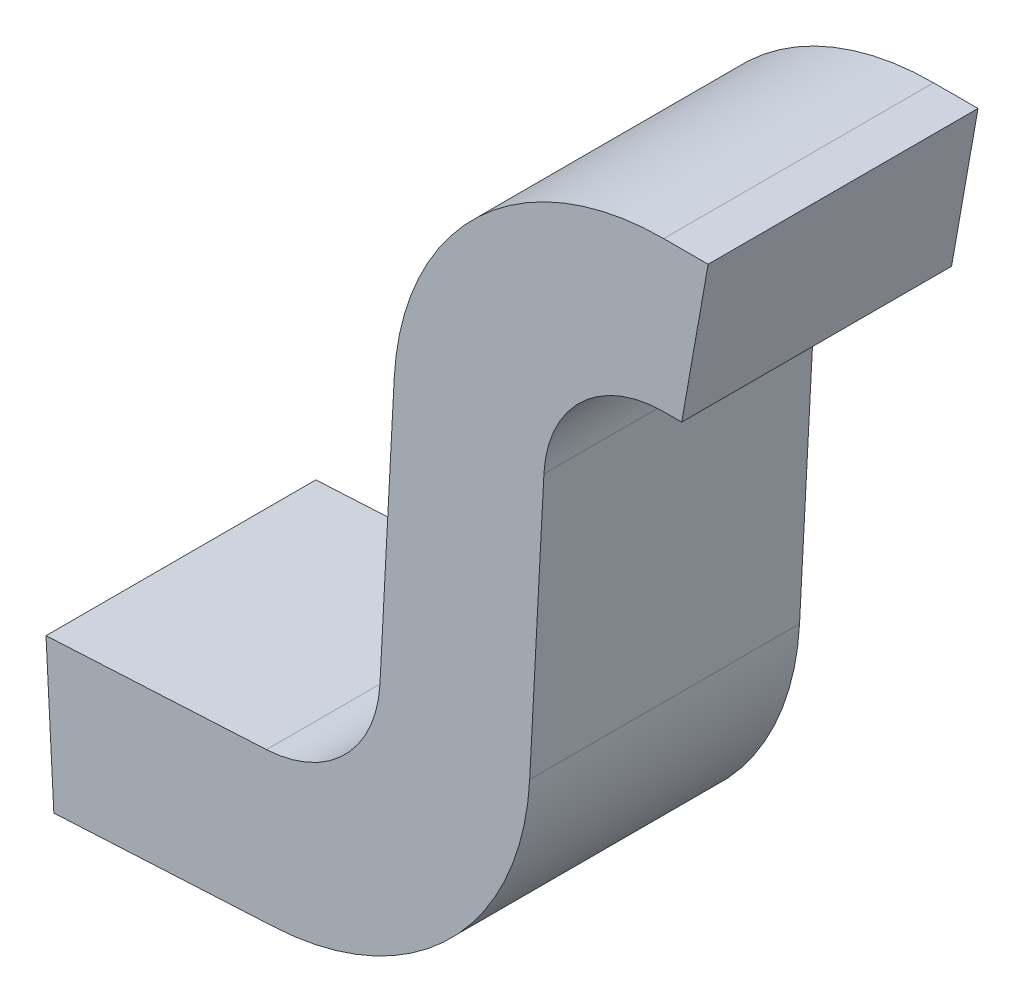
ISO-10303-21;
HEADER;
FILE_DESCRIPTION(('STEP AP214'),'2;1');
FILE_NAME('part.step','',(''),(''),'','','');
FILE_SCHEMA(('AUTOMOTIVE_DESIGN { 1 0 10303 214 1 1 1 1 }'));
ENDSEC;
DATA;
#1=APPLICATION_CONTEXT('core data for automotive mechanical design processes');
#2=APPLICATION_PROTOCOL_DEFINITION('international standard','automotive_design',2000,#1);
#3=PRODUCT_CONTEXT('',#1,'mechanical');
#4=PRODUCT('Part','Part','',(#3));
#5=PRODUCT_RELATED_PRODUCT_CATEGORY('part','',(#4));
#6=PRODUCT_DEFINITION_FORMATION('','',#4);
#7=PRODUCT_DEFINITION_CONTEXT('part definition',#1,'design');
#8=PRODUCT_DEFINITION('design','',#6,#7);
#9=PRODUCT_DEFINITION_SHAPE('','',#8);
#10=(LENGTH_UNIT() NAMED_UNIT(*) SI_UNIT(.MILLI.,.METRE.));
#11=(NAMED_UNIT(*) PLANE_ANGLE_UNIT() SI_UNIT($,.RADIAN.));
#12=(NAMED_UNIT(*) SI_UNIT($,.STERADIAN.) SOLID_ANGLE_UNIT());
#13=UNCERTAINTY_MEASURE_WITH_UNIT(LENGTH_MEASURE(1.E-05),#10,'distance_accuracy_value','');
#14=(GEOMETRIC_REPRESENTATION_CONTEXT(3) GLOBAL_UNCERTAINTY_ASSIGNED_CONTEXT((#13)) GLOBAL_UNIT_ASSIGNED_CONTEXT((#10,
#11,#12)) REPRESENTATION_CONTEXT('',''));
#15=CARTESIAN_POINT('',(0.,0.,0.));
#16=DIRECTION('',(0.,0.,1.));
#17=DIRECTION('',(1.,0.,0.));
#18=AXIS2_PLACEMENT_3D('',#15,#16,#17);
#19=CARTESIAN_POINT('',(0.,0.,0.1125));
#20=DIRECTION('',(0.,0.,-1.));
#21=DIRECTION('',(-1.,0.,0.));
#22=AXIS2_PLACEMENT_3D('',#19,#20,#21);
#23=PLANE('',#22);
#24=DIRECTION('',(0.0523359562429177,0.998629534754575,0.));
#25=VECTOR('',#24,1.);
#26=CARTESIAN_POINT('',(-0.861573213012,-0.31493822705,0.1125));
#27=LINE('',#26,#25);
#28=CARTESIAN_POINT('',(-0.849691645319655,-0.0882244098453541,0.1125));
#29=VERTEX_POINT('',#28);
#30=CARTESIAN_POINT('',(-0.861573213012008,-0.31493822705016,0.1125));
#31=VERTEX_POINT('',#30);
#32=EDGE_CURVE('E145',#29,#31,#27,.F.);
#33=ORIENTED_EDGE('',*,*,#32,.T.);
#34=CARTESIAN_POINT('',(-0.961436166488,-0.309704631426,0.1125));
#35=DIRECTION('',(0.,0.,-1.));
#36=DIRECTION('',(-1.,0.,0.));
#37=AXIS2_PLACEMENT_3D('',#34,#35,#36);
#38=CIRCLE('',#37,0.1);
#39=CARTESIAN_POINT('',(-0.956202570863354,-0.40956758490123,0.1125));
#40=VERTEX_POINT('',#39);
#41=EDGE_CURVE('E181',#31,#40,#38,.T.);
#42=ORIENTED_EDGE('',*,*,#41,.T.);
#43=DIRECTION('',(0.998629534754575,0.0523359562429177,0.));
#44=VECTOR('',#43,1.);
#45=CARTESIAN_POINT('',(-1.14,-0.4192,0.1125));
#46=LINE('',#45,#44);
#47=CARTESIAN_POINT('',(-1.14000000000012,-0.419200000000006,0.1125));
#48=VERTEX_POINT('',#47);
#49=EDGE_CURVE('E149',#40,#48,#46,.F.);
#50=ORIENTED_EDGE('',*,*,#49,.T.);
#51=DIRECTION('',(-0.0523359562429177,0.998629534754575,0.));
#52=VECTOR('',#51,1.);
#53=CARTESIAN_POINT('',(-1.13345800547,-0.544028691844,0.1125));
#54=LINE('',#53,#52);
#55=CARTESIAN_POINT('',(-1.13345800547,-0.544028691843999,0.1125));
#56=VERTEX_POINT('',#55);
#57=EDGE_CURVE('E155',#48,#56,#54,.F.);
#58=ORIENTED_EDGE('',*,*,#57,.T.);
#59=DIRECTION('',(-0.998629534754575,-0.0523359562429177,0.));
#60=VECTOR('',#59,1.);
#61=CARTESIAN_POINT('',(-0.949660576333,-0.534396276745,0.1125));
#62=LINE('',#61,#60);
#63=CARTESIAN_POINT('',(-0.949660576333192,-0.53439627674501,0.1125));
#64=VERTEX_POINT('',#63);
#65=EDGE_CURVE('E160',#56,#64,#62,.F.);
#66=ORIENTED_EDGE('',*,*,#65,.T.);
#67=CARTESIAN_POINT('',(-0.961436166488,-0.309704631426,0.1125));
#68=DIRECTION('',(0.,0.,-1.));
#69=DIRECTION('',(-1.,0.,0.));
#70=AXIS2_PLACEMENT_3D('',#67,#68,#69);
#71=CIRCLE('',#70,0.225);
#72=CARTESIAN_POINT('',(-0.736744521168336,-0.321480221580316,0.1125));
#73=VERTEX_POINT('',#72);
#74=EDGE_CURVE('E108',#73,#64,#71,.T.);
#75=ORIENTED_EDGE('',*,*,#74,.F.);
#76=DIRECTION('',(-0.0523359562429177,-0.998629534754575,0.));
#77=VECTOR('',#76,1.);
#78=CARTESIAN_POINT('',(-0.724862953476,-0.09476640437571,0.1125));
#79=LINE('',#78,#77);
#80=CARTESIAN_POINT('',(-0.724862953475999,-0.0947664043756949,0.1125));
#81=VERTEX_POINT('',#80);
#82=EDGE_CURVE('E103',#73,#81,#79,.F.);
#83=ORIENTED_EDGE('',*,*,#82,.T.);
#84=CARTESIAN_POINT('',(-0.625,-0.1,0.1125));
#85=DIRECTION('',(0.,0.,-1.));
#86=DIRECTION('',(-1.,0.,0.));
#87=AXIS2_PLACEMENT_3D('',#84,#85,#86);
#88=CIRCLE('',#87,0.1);
#89=CARTESIAN_POINT('',(-0.625,0.,0.1125));
#90=VERTEX_POINT('',#89);
#91=EDGE_CURVE('E20',#81,#90,#88,.T.);
#92=ORIENTED_EDGE('',*,*,#91,.T.);
#93=DIRECTION('',(1.,0.,0.));
#94=VECTOR('',#93,1.);
#95=CARTESIAN_POINT('',(-0.61,0.,0.1125));
#96=LINE('',#95,#94);
#97=CARTESIAN_POINT('',(-0.609999999999862,0.,0.1125));
#98=VERTEX_POINT('',#97);
#99=EDGE_CURVE('E129',#90,#98,#96,.T.);
#100=ORIENTED_EDGE('',*,*,#99,.T.);
#101=DIRECTION('',(-0.173648177667033,-0.98480775301219,0.));
#102=VECTOR('',#101,1.);
#103=CARTESIAN_POINT('',(-0.587959127411,0.125,0.1125));
#104=LINE('',#103,#102);
#105=CARTESIAN_POINT('',(-0.587959127411,0.125,0.1125));
#106=VERTEX_POINT('',#105);
#107=EDGE_CURVE('E134',#98,#106,#104,.F.);
#108=ORIENTED_EDGE('',*,*,#107,.T.);
#109=DIRECTION('',(1.,0.,0.));
#110=VECTOR('',#109,1.);
#111=CARTESIAN_POINT('',(-0.625,0.125,0.1125));
#112=LINE('',#111,#110);
#113=CARTESIAN_POINT('',(-0.625,0.125,0.1125));
#114=VERTEX_POINT('',#113);
#115=EDGE_CURVE('E140',#106,#114,#112,.F.);
#116=ORIENTED_EDGE('',*,*,#115,.T.);
#117=CARTESIAN_POINT('',(-0.625,-0.1,0.1125));
#118=DIRECTION('',(0.,0.,-1.));
#119=DIRECTION('',(-1.,0.,0.));
#120=AXIS2_PLACEMENT_3D('',#117,#118,#119);
#121=CIRCLE('',#120,0.225);
#122=EDGE_CURVE('E142',#29,#114,#121,.T.);
#123=ORIENTED_EDGE('',*,*,#122,.F.);
#124=EDGE_LOOP('',(#33,#42,#50,#58,#66,#75,#83,#92,#100,#108,#116,#123));
#125=FACE_BOUND('',#124,.T.);
#126=ADVANCED_FACE('F17',(#125),#23,.F.);
#127=CARTESIAN_POINT('',(-0.625,-0.1,-0.1125));
#128=DIRECTION('',(0.,0.,-1.));
#129=DIRECTION('',(-1.,0.,0.));
#130=AXIS2_PLACEMENT_3D('',#127,#128,#129);
#131=CYLINDRICAL_SURFACE('',#130,0.1);
#132=ORIENTED_EDGE('',*,*,#91,.F.);
#133=DIRECTION('',(0.,0.,1.));
#134=VECTOR('',#133,1.);
#135=CARTESIAN_POINT('',(-0.724862953476,-0.09476640437571,-0.1125));
#136=LINE('',#135,#134);
#137=CARTESIAN_POINT('',(-0.724862953476004,-0.0947664043757943,-0.1125));
#138=VERTEX_POINT('',#137);
#139=EDGE_CURVE('E112',#81,#138,#136,.F.);
#140=ORIENTED_EDGE('',*,*,#139,.T.);
#141=CARTESIAN_POINT('',(-0.625,-0.1,-0.1125));
#142=DIRECTION('',(0.,0.,-1.));
#143=DIRECTION('',(-1.,0.,0.));
#144=AXIS2_PLACEMENT_3D('',#141,#142,#143);
#145=CIRCLE('',#144,0.1);
#146=CARTESIAN_POINT('',(-0.625,0.,-0.1125));
#147=VERTEX_POINT('',#146);
#148=EDGE_CURVE('E131',#147,#138,#145,.F.);
#149=ORIENTED_EDGE('',*,*,#148,.F.);
#150=DIRECTION('',(0.,0.,1.));
#151=VECTOR('',#150,1.);
#152=CARTESIAN_POINT('',(-0.625,0.,-0.1125));
#153=LINE('',#152,#151);
#154=EDGE_CURVE('E118',#147,#90,#153,.T.);
#155=ORIENTED_EDGE('',*,*,#154,.T.);
#156=EDGE_LOOP('',(#132,#140,#149,#155));
#157=FACE_BOUND('',#156,.T.);
#158=ADVANCED_FACE('F115',(#157),#131,.F.);
#159=CARTESIAN_POINT('',(-0.724862953476,-0.09476640437571,-0.1125));
#160=DIRECTION('',(-0.998629534754575,0.0523359562429177,0.));
#161=DIRECTION('',(-0.0523359562429177,-0.998629534754575,0.));
#162=AXIS2_PLACEMENT_3D('',#159,#160,#161);
#163=PLANE('',#162);
#164=ORIENTED_EDGE('',*,*,#82,.F.);
#165=DIRECTION('',(0.,0.,-1.));
#166=VECTOR('',#165,1.);
#167=CARTESIAN_POINT('',(-0.736744521168186,-0.32148022157999,-0.1125));
#168=LINE('',#167,#166);
#169=CARTESIAN_POINT('',(-0.736744521168099,-0.321480221580105,-0.1125));
#170=VERTEX_POINT('',#169);
#171=EDGE_CURVE('E124',#170,#73,#168,.F.);
#172=ORIENTED_EDGE('',*,*,#171,.F.);
#173=DIRECTION('',(-0.0523359562409312,-0.998629534754679,0.));
#174=VECTOR('',#173,1.);
#175=CARTESIAN_POINT('',(-0.724862953476,-0.09476640437571,-0.1125));
#176=LINE('',#175,#174);
#177=EDGE_CURVE('E122',#138,#170,#176,.T.);
#178=ORIENTED_EDGE('',*,*,#177,.F.);
#179=ORIENTED_EDGE('',*,*,#139,.F.);
#180=EDGE_LOOP('',(#164,#172,#178,#179));
#181=FACE_BOUND('',#180,.T.);
#182=ADVANCED_FACE('F120',(#181),#163,.F.);
#183=CARTESIAN_POINT('',(-0.961436166488,-0.309704631426,-0.1125));
#184=DIRECTION('',(0.,0.,-1.));
#185=DIRECTION('',(-1.,0.,0.));
#186=AXIS2_PLACEMENT_3D('',#183,#184,#185);
#187=CYLINDRICAL_SURFACE('',#186,0.225);
#188=DIRECTION('',(0.,0.,1.));
#189=VECTOR('',#188,1.);
#190=CARTESIAN_POINT('',(-0.949660576333,-0.534396276745,-0.1125));
#191=LINE('',#190,#189);
#192=CARTESIAN_POINT('',(-0.94966057633319,-0.53439627674501,-0.1125));
#193=VERTEX_POINT('',#192);
#194=EDGE_CURVE('E157',#64,#193,#191,.F.);
#195=ORIENTED_EDGE('',*,*,#194,.T.);
#196=CARTESIAN_POINT('',(-0.961436166488,-0.309704631426,-0.1125));
#197=DIRECTION('',(0.,0.,-1.));
#198=DIRECTION('',(-1.,0.,0.));
#199=AXIS2_PLACEMENT_3D('',#196,#197,#198);
#200=CIRCLE('',#199,0.225);
#201=EDGE_CURVE('E173',#170,#193,#200,.T.);
#202=ORIENTED_EDGE('',*,*,#201,.F.);
#203=ORIENTED_EDGE('',*,*,#171,.T.);
#204=ORIENTED_EDGE('',*,*,#74,.T.);
#205=EDGE_LOOP('',(#195,#202,#203,#204));
#206=FACE_BOUND('',#205,.T.);
#207=ADVANCED_FACE('F184',(#206),#187,.T.);
#208=CARTESIAN_POINT('',(-0.949660576333,-0.534396276745,-0.1125));
#209=DIRECTION('',(-0.0523359562429177,0.998629534754575,0.));
#210=DIRECTION('',(-0.998629534754575,-0.0523359562429177,0.));
#211=AXIS2_PLACEMENT_3D('',#208,#209,#210);
#212=PLANE('',#211);
#213=ORIENTED_EDGE('',*,*,#65,.F.);
#214=DIRECTION('',(0.,0.,1.));
#215=VECTOR('',#214,1.);
#216=CARTESIAN_POINT('',(-1.13345800547,-0.544028691844,-0.1125));
#217=LINE('',#216,#215);
#218=CARTESIAN_POINT('',(-1.13345800547,-0.544028691844,-0.1125));
#219=VERTEX_POINT('',#218);
#220=EDGE_CURVE('E152',#56,#219,#217,.F.);
#221=ORIENTED_EDGE('',*,*,#220,.T.);
#222=DIRECTION('',(-0.998629534754574,-0.0523359562429318,0.));
#223=VECTOR('',#222,1.);
#224=CARTESIAN_POINT('',(-0.949660576333,-0.534396276745,-0.1125));
#225=LINE('',#224,#223);
#226=EDGE_CURVE('E176',#193,#219,#225,.T.);
#227=ORIENTED_EDGE('',*,*,#226,.F.);
#228=ORIENTED_EDGE('',*,*,#194,.F.);
#229=EDGE_LOOP('',(#213,#221,#227,#228));
#230=FACE_BOUND('',#229,.T.);
#231=ADVANCED_FACE('F189',(#230),#212,.F.);
#232=CARTESIAN_POINT('',(-1.13345800547,-0.544028691844,-0.1125));
#233=DIRECTION('',(0.998629534754575,0.0523359562429177,0.));
#234=DIRECTION('',(-0.0523359562429177,0.998629534754575,0.));
#235=AXIS2_PLACEMENT_3D('',#232,#233,#234);
#236=PLANE('',#235);
#237=ORIENTED_EDGE('',*,*,#57,.F.);
#238=DIRECTION('',(0.,0.,1.));
#239=VECTOR('',#238,1.);
#240=CARTESIAN_POINT('',(-1.14,-0.4192,-0.1125));
#241=LINE('',#240,#239);
#242=CARTESIAN_POINT('',(-1.14,-0.4192,-0.1125));
#243=VERTEX_POINT('',#242);
#244=EDGE_CURVE('E151',#48,#243,#241,.F.);
#245=ORIENTED_EDGE('',*,*,#244,.T.);
#246=DIRECTION('',(-0.0523359562401418,0.998629534754721,0.));
#247=VECTOR('',#246,1.);
#248=CARTESIAN_POINT('',(-1.13345800547,-0.544028691844,-0.1125));
#249=LINE('',#248,#247);
#250=EDGE_CURVE('E198',#219,#243,#249,.T.);
#251=ORIENTED_EDGE('',*,*,#250,.F.);
#252=ORIENTED_EDGE('',*,*,#220,.F.);
#253=EDGE_LOOP('',(#237,#245,#251,#252));
#254=FACE_BOUND('',#253,.T.);
#255=ADVANCED_FACE('F319',(#254),#236,.F.);
#256=CARTESIAN_POINT('',(-1.14,-0.4192,-0.1125));
#257=DIRECTION('',(0.0523359562429177,-0.998629534754575,0.));
#258=DIRECTION('',(0.998629534754575,0.0523359562429177,0.));
#259=AXIS2_PLACEMENT_3D('',#256,#257,#258);
#260=PLANE('',#259);
#261=ORIENTED_EDGE('',*,*,#49,.F.);
#262=DIRECTION('',(0.,0.,-1.));
#263=VECTOR('',#262,1.);
#264=CARTESIAN_POINT('',(-0.956202570862978,-0.409567584901419,-0.1125));
#265=LINE('',#264,#263);
#266=CARTESIAN_POINT('',(-0.956202570863353,-0.409567584901229,-0.1125));
#267=VERTEX_POINT('',#266);
#268=EDGE_CURVE('E148',#40,#267,#265,.T.);
#269=ORIENTED_EDGE('',*,*,#268,.T.);
#270=DIRECTION('',(0.998629534754574,0.0523359562429318,0.));
#271=VECTOR('',#270,1.);
#272=CARTESIAN_POINT('',(-1.14,-0.4192,-0.1125));
#273=LINE('',#272,#271);
#274=EDGE_CURVE('E172',#243,#267,#273,.T.);
#275=ORIENTED_EDGE('',*,*,#274,.F.);
#276=ORIENTED_EDGE('',*,*,#244,.F.);
#277=EDGE_LOOP('',(#261,#269,#275,#276));
#278=FACE_BOUND('',#277,.T.);
#279=ADVANCED_FACE('F309',(#278),#260,.F.);
#280=CARTESIAN_POINT('',(-0.961436166488,-0.309704631426,-0.1125));
#281=DIRECTION('',(0.,0.,-1.));
#282=DIRECTION('',(-1.,0.,0.));
#283=AXIS2_PLACEMENT_3D('',#280,#281,#282);
#284=CYLINDRICAL_SURFACE('',#283,0.1);
#285=ORIENTED_EDGE('',*,*,#41,.F.);
#286=DIRECTION('',(0.,0.,1.));
#287=VECTOR('',#286,1.);
#288=CARTESIAN_POINT('',(-0.861573213012,-0.31493822705,-0.1125));
#289=LINE('',#288,#287);
#290=CARTESIAN_POINT('',(-0.861573213012003,-0.314938227050056,-0.1125));
#291=VERTEX_POINT('',#290);
#292=EDGE_CURVE('E147',#31,#291,#289,.F.);
#293=ORIENTED_EDGE('',*,*,#292,.T.);
#294=CARTESIAN_POINT('',(-0.961436166488,-0.309704631426,-0.1125));
#295=DIRECTION('',(0.,0.,-1.));
#296=DIRECTION('',(-1.,0.,0.));
#297=AXIS2_PLACEMENT_3D('',#294,#295,#296);
#298=CIRCLE('',#297,0.1);
#299=EDGE_CURVE('E169',#267,#291,#298,.F.);
#300=ORIENTED_EDGE('',*,*,#299,.F.);
#301=ORIENTED_EDGE('',*,*,#268,.F.);
#302=EDGE_LOOP('',(#285,#293,#300,#301));
#303=FACE_BOUND('',#302,.T.);
#304=ADVANCED_FACE('F299',(#303),#284,.F.);
#305=CARTESIAN_POINT('',(-0.861573213012,-0.31493822705,-0.1125));
#306=DIRECTION('',(0.998629534754575,-0.0523359562429177,0.));
#307=DIRECTION('',(0.0523359562429177,0.998629534754575,0.));
#308=AXIS2_PLACEMENT_3D('',#305,#306,#307);
#309=PLANE('',#308);
#310=ORIENTED_EDGE('',*,*,#32,.F.);
#311=DIRECTION('',(0.,0.,-1.));
#312=VECTOR('',#311,1.);
#313=CARTESIAN_POINT('',(-0.84969164531978,-0.0882244098453515,-0.1125));
#314=LINE('',#313,#312);
#315=CARTESIAN_POINT('',(-0.849691645319902,-0.0882244098455748,-0.1125));
#316=VERTEX_POINT('',#315);
#317=EDGE_CURVE('E180',#316,#29,#314,.F.);
#318=ORIENTED_EDGE('',*,*,#317,.F.);
#319=DIRECTION('',(0.052335956240846,0.998629534754684,0.));
#320=VECTOR('',#319,1.);
#321=CARTESIAN_POINT('',(-0.861573213012,-0.31493822705,-0.1125));
#322=LINE('',#321,#320);
#323=EDGE_CURVE('E168',#291,#316,#322,.T.);
#324=ORIENTED_EDGE('',*,*,#323,.F.);
#325=ORIENTED_EDGE('',*,*,#292,.F.);
#326=EDGE_LOOP('',(#310,#318,#324,#325));
#327=FACE_BOUND('',#326,.T.);
#328=ADVANCED_FACE('F289',(#327),#309,.F.);
#329=CARTESIAN_POINT('',(-0.625,-0.1,-0.1125));
#330=DIRECTION('',(0.,0.,-1.));
#331=DIRECTION('',(-1.,0.,0.));
#332=AXIS2_PLACEMENT_3D('',#329,#330,#331);
#333=CYLINDRICAL_SURFACE('',#332,0.225);
#334=DIRECTION('',(0.,0.,-1.));
#335=VECTOR('',#334,1.);
#336=CARTESIAN_POINT('',(-0.625,0.125,-0.1125));
#337=LINE('',#336,#335);
#338=CARTESIAN_POINT('',(-0.625,0.125,-0.1125));
#339=VERTEX_POINT('',#338);
#340=EDGE_CURVE('E137',#114,#339,#337,.T.);
#341=ORIENTED_EDGE('',*,*,#340,.T.);
#342=CARTESIAN_POINT('',(-0.625,-0.1,-0.1125));
#343=DIRECTION('',(0.,0.,-1.));
#344=DIRECTION('',(-1.,0.,0.));
#345=AXIS2_PLACEMENT_3D('',#342,#343,#344);
#346=CIRCLE('',#345,0.225);
#347=EDGE_CURVE('E164',#316,#339,#346,.T.);
#348=ORIENTED_EDGE('',*,*,#347,.F.);
#349=ORIENTED_EDGE('',*,*,#317,.T.);
#350=ORIENTED_EDGE('',*,*,#122,.T.);
#351=EDGE_LOOP('',(#341,#348,#349,#350));
#352=FACE_BOUND('',#351,.T.);
#353=ADVANCED_FACE('F255',(#352),#333,.T.);
#354=CARTESIAN_POINT('',(-0.625,0.125,-0.1125));
#355=DIRECTION('',(0.,-1.,0.));
#356=DIRECTION('',(0.,0.,-1.));
#357=AXIS2_PLACEMENT_3D('',#354,#355,#356);
#358=PLANE('',#357);
#359=ORIENTED_EDGE('',*,*,#115,.F.);
#360=DIRECTION('',(0.,0.,1.));
#361=VECTOR('',#360,1.);
#362=CARTESIAN_POINT('',(-0.587959127411,0.125,-0.1125));
#363=LINE('',#362,#361);
#364=CARTESIAN_POINT('',(-0.587959127411,0.125,-0.1125));
#365=VERTEX_POINT('',#364);
#366=EDGE_CURVE('E136',#106,#365,#363,.F.);
#367=ORIENTED_EDGE('',*,*,#366,.T.);
#368=DIRECTION('',(-1.,0.,0.));
#369=VECTOR('',#368,1.);
#370=CARTESIAN_POINT('',(0.,0.125,-0.1125));
#371=LINE('',#370,#369);
#372=EDGE_CURVE('E167',#339,#365,#371,.F.);
#373=ORIENTED_EDGE('',*,*,#372,.F.);
#374=ORIENTED_EDGE('',*,*,#340,.F.);
#375=EDGE_LOOP('',(#359,#367,#373,#374));
#376=FACE_BOUND('',#375,.T.);
#377=ADVANCED_FACE('F242',(#376),#358,.F.);
#378=CARTESIAN_POINT('',(-0.587959127411,0.125,-0.1125));
#379=DIRECTION('',(-0.98480775301219,0.173648177667033,0.));
#380=DIRECTION('',(-0.173648177667033,-0.98480775301219,0.));
#381=AXIS2_PLACEMENT_3D('',#378,#379,#380);
#382=PLANE('',#381);
#383=ORIENTED_EDGE('',*,*,#366,.F.);
#384=ORIENTED_EDGE('',*,*,#107,.F.);
#385=DIRECTION('',(0.,0.,1.));
#386=VECTOR('',#385,1.);
#387=CARTESIAN_POINT('',(-0.61,0.,-0.1125));
#388=LINE('',#387,#386);
#389=CARTESIAN_POINT('',(-0.61,0.,-0.1125));
#390=VERTEX_POINT('',#389);
#391=EDGE_CURVE('E35',#98,#390,#388,.F.);
#392=ORIENTED_EDGE('',*,*,#391,.T.);
#393=DIRECTION('',(-0.173648177670306,-0.984807753011613,0.));
#394=VECTOR('',#393,1.);
#395=CARTESIAN_POINT('',(-0.587959127411,0.125,-0.1125));
#396=LINE('',#395,#394);
#397=EDGE_CURVE('E26',#365,#390,#396,.T.);
#398=ORIENTED_EDGE('',*,*,#397,.F.);
#399=EDGE_LOOP('',(#383,#384,#392,#398));
#400=FACE_BOUND('',#399,.T.);
#401=ADVANCED_FACE('F244',(#400),#382,.F.);
#402=CARTESIAN_POINT('',(-0.61,0.,-0.1125));
#403=DIRECTION('',(0.,1.,0.));
#404=DIRECTION('',(0.,0.,1.));
#405=AXIS2_PLACEMENT_3D('',#402,#403,#404);
#406=PLANE('',#405);
#407=ORIENTED_EDGE('',*,*,#154,.F.);
#408=DIRECTION('',(-1.,0.,0.));
#409=VECTOR('',#408,1.);
#410=CARTESIAN_POINT('',(0.,0.,-0.1125));
#411=LINE('',#410,#409);
#412=EDGE_CURVE('E11',#390,#147,#411,.T.);
#413=ORIENTED_EDGE('',*,*,#412,.F.);
#414=ORIENTED_EDGE('',*,*,#391,.F.);
#415=ORIENTED_EDGE('',*,*,#99,.F.);
#416=EDGE_LOOP('',(#407,#413,#414,#415));
#417=FACE_BOUND('',#416,.T.);
#418=ADVANCED_FACE('F246',(#417),#406,.F.);
#419=CARTESIAN_POINT('',(0.,0.,-0.1125));
#420=DIRECTION('',(0.,0.,-1.));
#421=DIRECTION('',(-1.,0.,0.));
#422=AXIS2_PLACEMENT_3D('',#419,#420,#421);
#423=PLANE('',#422);
#424=ORIENTED_EDGE('',*,*,#397,.T.);
#425=ORIENTED_EDGE('',*,*,#412,.T.);
#426=ORIENTED_EDGE('',*,*,#148,.T.);
#427=ORIENTED_EDGE('',*,*,#177,.T.);
#428=ORIENTED_EDGE('',*,*,#201,.T.);
#429=ORIENTED_EDGE('',*,*,#226,.T.);
#430=ORIENTED_EDGE('',*,*,#250,.T.);
#431=ORIENTED_EDGE('',*,*,#274,.T.);
#432=ORIENTED_EDGE('',*,*,#299,.T.);
#433=ORIENTED_EDGE('',*,*,#323,.T.);
#434=ORIENTED_EDGE('',*,*,#347,.T.);
#435=ORIENTED_EDGE('',*,*,#372,.T.);
#436=EDGE_LOOP('',(#424,#425,#426,#427,#428,#429,#430,#431,#432,#433,#434,#435));
#437=FACE_BOUND('',#436,.T.);
#438=ADVANCED_FACE('F237',(#437),#423,.T.);
#439=CLOSED_SHELL('',(#126,#158,#182,#207,#231,#255,#279,#304,#328,#353,#377,#401,#418,#438));
#440=MANIFOLD_SOLID_BREP('B1',#439);
#441=ADVANCED_BREP_SHAPE_REPRESENTATION('',(#18,#440),#14);
#442=SHAPE_DEFINITION_REPRESENTATION(#9,#441);
ENDSEC;
END-ISO-10303-21;
